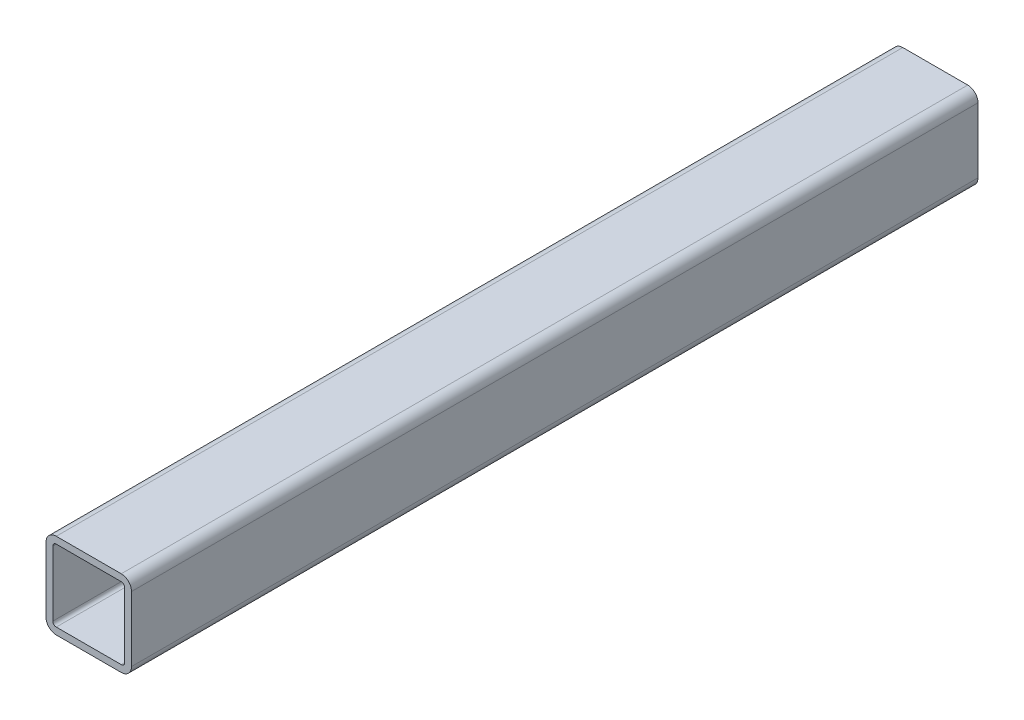
ISO-10303-21;
HEADER;
FILE_DESCRIPTION(('STEP AP214'),'2;1');
FILE_NAME('part.step','',(''),(''),'','','');
FILE_SCHEMA(('AUTOMOTIVE_DESIGN { 1 0 10303 214 1 1 1 1 }'));
ENDSEC;
DATA;
#1=APPLICATION_CONTEXT('core data for automotive mechanical design processes');
#2=APPLICATION_PROTOCOL_DEFINITION('international standard','automotive_design',2000,#1);
#3=PRODUCT_CONTEXT('',#1,'mechanical');
#4=PRODUCT('Part','Part','',(#3));
#5=PRODUCT_RELATED_PRODUCT_CATEGORY('part','',(#4));
#6=PRODUCT_DEFINITION_FORMATION('','',#4);
#7=PRODUCT_DEFINITION_CONTEXT('part definition',#1,'design');
#8=PRODUCT_DEFINITION('design','',#6,#7);
#9=PRODUCT_DEFINITION_SHAPE('','',#8);
#10=(LENGTH_UNIT() NAMED_UNIT(*) SI_UNIT(.MILLI.,.METRE.));
#11=(NAMED_UNIT(*) PLANE_ANGLE_UNIT() SI_UNIT($,.RADIAN.));
#12=(NAMED_UNIT(*) SI_UNIT($,.STERADIAN.) SOLID_ANGLE_UNIT());
#13=UNCERTAINTY_MEASURE_WITH_UNIT(LENGTH_MEASURE(1.E-05),#10,'distance_accuracy_value','');
#14=(GEOMETRIC_REPRESENTATION_CONTEXT(3) GLOBAL_UNCERTAINTY_ASSIGNED_CONTEXT((#13)) GLOBAL_UNIT_ASSIGNED_CONTEXT((#10,
#11,#12)) REPRESENTATION_CONTEXT('',''));
#15=CARTESIAN_POINT('',(0.,0.,0.));
#16=DIRECTION('',(0.,0.,1.));
#17=DIRECTION('',(1.,0.,0.));
#18=AXIS2_PLACEMENT_3D('',#15,#16,#17);
#19=CARTESIAN_POINT('',(0.,0.,247.5));
#20=DIRECTION('',(0.,0.,1.));
#21=DIRECTION('',(1.,0.,0.));
#22=AXIS2_PLACEMENT_3D('',#19,#20,#21);
#23=PLANE('',#22);
#24=DIRECTION('',(0.,1.,0.));
#25=VECTOR('',#24,1.);
#26=CARTESIAN_POINT('',(-12.5,-4.75,247.5));
#27=LINE('',#26,#25);
#28=CARTESIAN_POINT('',(-12.5,-9.5,247.5));
#29=VERTEX_POINT('',#28);
#30=CARTESIAN_POINT('',(-12.5,9.5,247.5));
#31=VERTEX_POINT('',#30);
#32=EDGE_CURVE('E256',#29,#31,#27,.T.);
#33=ORIENTED_EDGE('',*,*,#32,.F.);
#34=CARTESIAN_POINT('',(-9.5,-9.5,247.5));
#35=DIRECTION('',(0.,0.,-1.));
#36=DIRECTION('',(1.,0.,0.));
#37=AXIS2_PLACEMENT_3D('',#34,#35,#36);
#38=CIRCLE('',#37,3.);
#39=CARTESIAN_POINT('',(-9.5,-12.5,247.5));
#40=VERTEX_POINT('',#39);
#41=EDGE_CURVE('E197',#40,#29,#38,.T.);
#42=ORIENTED_EDGE('',*,*,#41,.F.);
#43=DIRECTION('',(-1.,0.,0.));
#44=VECTOR('',#43,1.);
#45=CARTESIAN_POINT('',(4.75,-12.5,247.5));
#46=LINE('',#45,#44);
#47=CARTESIAN_POINT('',(9.5,-12.5,247.5));
#48=VERTEX_POINT('',#47);
#49=EDGE_CURVE('E190',#48,#40,#46,.T.);
#50=ORIENTED_EDGE('',*,*,#49,.F.);
#51=CARTESIAN_POINT('',(9.5,-9.5,247.5));
#52=DIRECTION('',(0.,0.,-1.));
#53=DIRECTION('',(0.,1.,0.));
#54=AXIS2_PLACEMENT_3D('',#51,#52,#53);
#55=CIRCLE('',#54,3.);
#56=CARTESIAN_POINT('',(12.5,-9.5,247.5));
#57=VERTEX_POINT('',#56);
#58=EDGE_CURVE('E266',#57,#48,#55,.T.);
#59=ORIENTED_EDGE('',*,*,#58,.F.);
#60=DIRECTION('',(0.,-1.,0.));
#61=VECTOR('',#60,1.);
#62=CARTESIAN_POINT('',(12.5,4.75,247.5));
#63=LINE('',#62,#61);
#64=CARTESIAN_POINT('',(12.5,9.5,247.5));
#65=VERTEX_POINT('',#64);
#66=EDGE_CURVE('E337',#65,#57,#63,.T.);
#67=ORIENTED_EDGE('',*,*,#66,.F.);
#68=CARTESIAN_POINT('',(9.5,9.5,247.5));
#69=DIRECTION('',(0.,0.,-1.));
#70=DIRECTION('',(-1.,0.,0.));
#71=AXIS2_PLACEMENT_3D('',#68,#69,#70);
#72=CIRCLE('',#71,3.);
#73=CARTESIAN_POINT('',(9.5,12.5,247.5));
#74=VERTEX_POINT('',#73);
#75=EDGE_CURVE('E27',#74,#65,#72,.T.);
#76=ORIENTED_EDGE('',*,*,#75,.F.);
#77=DIRECTION('',(1.,0.,0.));
#78=VECTOR('',#77,1.);
#79=CARTESIAN_POINT('',(-4.75,12.5,247.5));
#80=LINE('',#79,#78);
#81=CARTESIAN_POINT('',(-9.5,12.5,247.5));
#82=VERTEX_POINT('',#81);
#83=EDGE_CURVE('E235',#82,#74,#80,.T.);
#84=ORIENTED_EDGE('',*,*,#83,.F.);
#85=CARTESIAN_POINT('',(-9.5,9.5,247.5));
#86=DIRECTION('',(0.,0.,-1.));
#87=DIRECTION('',(0.,-1.,0.));
#88=AXIS2_PLACEMENT_3D('',#85,#86,#87);
#89=CIRCLE('',#88,3.);
#90=EDGE_CURVE('E225',#31,#82,#89,.T.);
#91=ORIENTED_EDGE('',*,*,#90,.F.);
#92=EDGE_LOOP('',(#33,#42,#50,#59,#67,#76,#84,#91));
#93=FACE_BOUND('',#92,.T.);
#94=DIRECTION('',(-1.,0.,0.));
#95=VECTOR('',#94,1.);
#96=CARTESIAN_POINT('',(-4.75,10.5,247.5));
#97=LINE('',#96,#95);
#98=CARTESIAN_POINT('',(9.5,10.5,247.5));
#99=VERTEX_POINT('',#98);
#100=CARTESIAN_POINT('',(-9.5,10.5,247.5));
#101=VERTEX_POINT('',#100);
#102=EDGE_CURVE('E153',#99,#101,#97,.T.);
#103=ORIENTED_EDGE('',*,*,#102,.F.);
#104=CARTESIAN_POINT('',(9.5,9.5,247.5));
#105=DIRECTION('',(0.,0.,1.));
#106=DIRECTION('',(-1.,0.,0.));
#107=AXIS2_PLACEMENT_3D('',#104,#105,#106);
#108=CIRCLE('',#107,1.);
#109=CARTESIAN_POINT('',(10.5,9.5,247.5));
#110=VERTEX_POINT('',#109);
#111=EDGE_CURVE('E147',#110,#99,#108,.T.);
#112=ORIENTED_EDGE('',*,*,#111,.F.);
#113=DIRECTION('',(0.,1.,0.));
#114=VECTOR('',#113,1.);
#115=CARTESIAN_POINT('',(10.5,4.75,247.5));
#116=LINE('',#115,#114);
#117=CARTESIAN_POINT('',(10.5,-9.5,247.5));
#118=VERTEX_POINT('',#117);
#119=EDGE_CURVE('E150',#118,#110,#116,.T.);
#120=ORIENTED_EDGE('',*,*,#119,.F.);
#121=CARTESIAN_POINT('',(9.5,-9.5,247.5));
#122=DIRECTION('',(0.,0.,1.));
#123=DIRECTION('',(0.,1.,0.));
#124=AXIS2_PLACEMENT_3D('',#121,#122,#123);
#125=CIRCLE('',#124,1.);
#126=CARTESIAN_POINT('',(9.5,-10.5,247.5));
#127=VERTEX_POINT('',#126);
#128=EDGE_CURVE('E217',#127,#118,#125,.T.);
#129=ORIENTED_EDGE('',*,*,#128,.F.);
#130=DIRECTION('',(1.,0.,0.));
#131=VECTOR('',#130,1.);
#132=CARTESIAN_POINT('',(4.75,-10.5,247.5));
#133=LINE('',#132,#131);
#134=CARTESIAN_POINT('',(-9.5,-10.5,247.5));
#135=VERTEX_POINT('',#134);
#136=EDGE_CURVE('E185',#135,#127,#133,.T.);
#137=ORIENTED_EDGE('',*,*,#136,.F.);
#138=CARTESIAN_POINT('',(-9.5,-9.5,247.5));
#139=DIRECTION('',(0.,0.,1.));
#140=DIRECTION('',(1.,0.,0.));
#141=AXIS2_PLACEMENT_3D('',#138,#139,#140);
#142=CIRCLE('',#141,1.);
#143=CARTESIAN_POINT('',(-10.5,-9.5,247.5));
#144=VERTEX_POINT('',#143);
#145=EDGE_CURVE('E208',#144,#135,#142,.T.);
#146=ORIENTED_EDGE('',*,*,#145,.F.);
#147=DIRECTION('',(0.,-1.,0.));
#148=VECTOR('',#147,1.);
#149=CARTESIAN_POINT('',(-10.5,-4.75,247.5));
#150=LINE('',#149,#148);
#151=CARTESIAN_POINT('',(-10.5,9.5,247.5));
#152=VERTEX_POINT('',#151);
#153=EDGE_CURVE('E224',#152,#144,#150,.T.);
#154=ORIENTED_EDGE('',*,*,#153,.F.);
#155=CARTESIAN_POINT('',(-9.5,9.5,247.5));
#156=DIRECTION('',(0.,0.,1.));
#157=DIRECTION('',(0.,-1.,0.));
#158=AXIS2_PLACEMENT_3D('',#155,#156,#157);
#159=CIRCLE('',#158,1.);
#160=EDGE_CURVE('E272',#101,#152,#159,.T.);
#161=ORIENTED_EDGE('',*,*,#160,.F.);
#162=EDGE_LOOP('',(#103,#112,#120,#129,#137,#146,#154,#161));
#163=FACE_BOUND('',#162,.T.);
#164=ADVANCED_FACE('F16',(#93,#163),#23,.T.);
#165=CARTESIAN_POINT('',(0.,0.,0.));
#166=DIRECTION('',(0.,0.,1.));
#167=DIRECTION('',(1.,0.,0.));
#168=AXIS2_PLACEMENT_3D('',#165,#166,#167);
#169=PLANE('',#168);
#170=DIRECTION('',(0.,1.,0.));
#171=VECTOR('',#170,1.);
#172=CARTESIAN_POINT('',(-12.5,-4.75,0.));
#173=LINE('',#172,#171);
#174=CARTESIAN_POINT('',(-12.5,-9.5,0.));
#175=VERTEX_POINT('',#174);
#176=CARTESIAN_POINT('',(-12.5,9.5,0.));
#177=VERTEX_POINT('',#176);
#178=EDGE_CURVE('E230',#175,#177,#173,.T.);
#179=ORIENTED_EDGE('',*,*,#178,.T.);
#180=CARTESIAN_POINT('',(-9.5,9.5,0.));
#181=DIRECTION('',(0.,0.,-1.));
#182=DIRECTION('',(0.,-1.,0.));
#183=AXIS2_PLACEMENT_3D('',#180,#181,#182);
#184=CIRCLE('',#183,3.);
#185=CARTESIAN_POINT('',(-9.5,12.5,0.));
#186=VERTEX_POINT('',#185);
#187=EDGE_CURVE('E239',#177,#186,#184,.T.);
#188=ORIENTED_EDGE('',*,*,#187,.T.);
#189=DIRECTION('',(1.,0.,0.));
#190=VECTOR('',#189,1.);
#191=CARTESIAN_POINT('',(-4.75,12.5,0.));
#192=LINE('',#191,#190);
#193=CARTESIAN_POINT('',(9.5,12.5,0.));
#194=VERTEX_POINT('',#193);
#195=EDGE_CURVE('E241',#186,#194,#192,.T.);
#196=ORIENTED_EDGE('',*,*,#195,.T.);
#197=CARTESIAN_POINT('',(9.5,9.5,0.));
#198=DIRECTION('',(0.,0.,-1.));
#199=DIRECTION('',(-1.,0.,0.));
#200=AXIS2_PLACEMENT_3D('',#197,#198,#199);
#201=CIRCLE('',#200,3.);
#202=CARTESIAN_POINT('',(12.5,9.5,0.));
#203=VERTEX_POINT('',#202);
#204=EDGE_CURVE('E11',#194,#203,#201,.T.);
#205=ORIENTED_EDGE('',*,*,#204,.T.);
#206=DIRECTION('',(0.,-1.,0.));
#207=VECTOR('',#206,1.);
#208=CARTESIAN_POINT('',(12.5,4.75,0.));
#209=LINE('',#208,#207);
#210=CARTESIAN_POINT('',(12.5,-9.5,0.));
#211=VERTEX_POINT('',#210);
#212=EDGE_CURVE('E283',#203,#211,#209,.T.);
#213=ORIENTED_EDGE('',*,*,#212,.T.);
#214=CARTESIAN_POINT('',(9.5,-9.5,0.));
#215=DIRECTION('',(0.,0.,-1.));
#216=DIRECTION('',(0.,1.,0.));
#217=AXIS2_PLACEMENT_3D('',#214,#215,#216);
#218=CIRCLE('',#217,3.);
#219=CARTESIAN_POINT('',(9.5,-12.5,0.));
#220=VERTEX_POINT('',#219);
#221=EDGE_CURVE('E186',#211,#220,#218,.T.);
#222=ORIENTED_EDGE('',*,*,#221,.T.);
#223=DIRECTION('',(-1.,0.,0.));
#224=VECTOR('',#223,1.);
#225=CARTESIAN_POINT('',(4.75,-12.5,0.));
#226=LINE('',#225,#224);
#227=CARTESIAN_POINT('',(-9.5,-12.5,0.));
#228=VERTEX_POINT('',#227);
#229=EDGE_CURVE('E20',#220,#228,#226,.T.);
#230=ORIENTED_EDGE('',*,*,#229,.T.);
#231=CARTESIAN_POINT('',(-9.5,-9.5,0.));
#232=DIRECTION('',(0.,0.,-1.));
#233=DIRECTION('',(1.,0.,0.));
#234=AXIS2_PLACEMENT_3D('',#231,#232,#233);
#235=CIRCLE('',#234,3.);
#236=EDGE_CURVE('E196',#228,#175,#235,.T.);
#237=ORIENTED_EDGE('',*,*,#236,.T.);
#238=EDGE_LOOP('',(#179,#188,#196,#205,#213,#222,#230,#237));
#239=FACE_BOUND('',#238,.T.);
#240=DIRECTION('',(-1.,0.,0.));
#241=VECTOR('',#240,1.);
#242=CARTESIAN_POINT('',(-4.75,10.5,0.));
#243=LINE('',#242,#241);
#244=CARTESIAN_POINT('',(9.5,10.5,0.));
#245=VERTEX_POINT('',#244);
#246=CARTESIAN_POINT('',(-9.5,10.5,0.));
#247=VERTEX_POINT('',#246);
#248=EDGE_CURVE('E213',#245,#247,#243,.T.);
#249=ORIENTED_EDGE('',*,*,#248,.T.);
#250=CARTESIAN_POINT('',(-9.5,9.5,0.));
#251=DIRECTION('',(0.,0.,1.));
#252=DIRECTION('',(0.,-1.,0.));
#253=AXIS2_PLACEMENT_3D('',#250,#251,#252);
#254=CIRCLE('',#253,1.);
#255=CARTESIAN_POINT('',(-10.5,9.5,0.));
#256=VERTEX_POINT('',#255);
#257=EDGE_CURVE('E270',#247,#256,#254,.T.);
#258=ORIENTED_EDGE('',*,*,#257,.T.);
#259=DIRECTION('',(0.,-1.,0.));
#260=VECTOR('',#259,1.);
#261=CARTESIAN_POINT('',(-10.5,-4.75,0.));
#262=LINE('',#261,#260);
#263=CARTESIAN_POINT('',(-10.5,-9.5,0.));
#264=VERTEX_POINT('',#263);
#265=EDGE_CURVE('E219',#256,#264,#262,.T.);
#266=ORIENTED_EDGE('',*,*,#265,.T.);
#267=CARTESIAN_POINT('',(-9.5,-9.5,0.));
#268=DIRECTION('',(0.,0.,1.));
#269=DIRECTION('',(1.,0.,0.));
#270=AXIS2_PLACEMENT_3D('',#267,#268,#269);
#271=CIRCLE('',#270,1.);
#272=CARTESIAN_POINT('',(-9.5,-10.5,0.));
#273=VERTEX_POINT('',#272);
#274=EDGE_CURVE('E212',#264,#273,#271,.T.);
#275=ORIENTED_EDGE('',*,*,#274,.T.);
#276=DIRECTION('',(1.,0.,0.));
#277=VECTOR('',#276,1.);
#278=CARTESIAN_POINT('',(4.75,-10.5,0.));
#279=LINE('',#278,#277);
#280=CARTESIAN_POINT('',(9.5,-10.5,0.));
#281=VERTEX_POINT('',#280);
#282=EDGE_CURVE('E205',#273,#281,#279,.T.);
#283=ORIENTED_EDGE('',*,*,#282,.T.);
#284=CARTESIAN_POINT('',(9.5,-9.5,0.));
#285=DIRECTION('',(0.,0.,1.));
#286=DIRECTION('',(0.,1.,0.));
#287=AXIS2_PLACEMENT_3D('',#284,#285,#286);
#288=CIRCLE('',#287,1.);
#289=CARTESIAN_POINT('',(10.5,-9.5,0.));
#290=VERTEX_POINT('',#289);
#291=EDGE_CURVE('E175',#281,#290,#288,.T.);
#292=ORIENTED_EDGE('',*,*,#291,.T.);
#293=DIRECTION('',(0.,1.,0.));
#294=VECTOR('',#293,1.);
#295=CARTESIAN_POINT('',(10.5,4.75,0.));
#296=LINE('',#295,#294);
#297=CARTESIAN_POINT('',(10.5,9.5,0.));
#298=VERTEX_POINT('',#297);
#299=EDGE_CURVE('E159',#290,#298,#296,.T.);
#300=ORIENTED_EDGE('',*,*,#299,.T.);
#301=CARTESIAN_POINT('',(9.5,9.5,0.));
#302=DIRECTION('',(0.,0.,1.));
#303=DIRECTION('',(-1.,0.,0.));
#304=AXIS2_PLACEMENT_3D('',#301,#302,#303);
#305=CIRCLE('',#304,1.);
#306=EDGE_CURVE('E165',#298,#245,#305,.T.);
#307=ORIENTED_EDGE('',*,*,#306,.T.);
#308=EDGE_LOOP('',(#249,#258,#266,#275,#283,#292,#300,#307));
#309=FACE_BOUND('',#308,.T.);
#310=ADVANCED_FACE('F347',(#239,#309),#169,.F.);
#311=CARTESIAN_POINT('',(9.5,9.5,0.));
#312=DIRECTION('',(0.,0.,1.));
#313=DIRECTION('',(-1.,0.,0.));
#314=AXIS2_PLACEMENT_3D('',#311,#312,#313);
#315=CYLINDRICAL_SURFACE('',#314,3.);
#316=ORIENTED_EDGE('',*,*,#75,.T.);
#317=DIRECTION('',(0.,0.,1.));
#318=VECTOR('',#317,1.);
#319=CARTESIAN_POINT('',(12.5,9.5,0.));
#320=LINE('',#319,#318);
#321=EDGE_CURVE('E280',#203,#65,#320,.T.);
#322=ORIENTED_EDGE('',*,*,#321,.F.);
#323=ORIENTED_EDGE('',*,*,#204,.F.);
#324=DIRECTION('',(0.,0.,1.));
#325=VECTOR('',#324,1.);
#326=CARTESIAN_POINT('',(9.5,12.5,0.));
#327=LINE('',#326,#325);
#328=EDGE_CURVE('E238',#194,#74,#327,.T.);
#329=ORIENTED_EDGE('',*,*,#328,.T.);
#330=EDGE_LOOP('',(#316,#322,#323,#329));
#331=FACE_BOUND('',#330,.T.);
#332=ADVANCED_FACE('F531',(#331),#315,.T.);
#333=CARTESIAN_POINT('',(-9.5,12.5,0.));
#334=DIRECTION('',(0.,1.,0.));
#335=DIRECTION('',(1.,0.,0.));
#336=AXIS2_PLACEMENT_3D('',#333,#334,#335);
#337=PLANE('',#336);
#338=ORIENTED_EDGE('',*,*,#83,.T.);
#339=ORIENTED_EDGE('',*,*,#328,.F.);
#340=ORIENTED_EDGE('',*,*,#195,.F.);
#341=DIRECTION('',(0.,0.,1.));
#342=VECTOR('',#341,1.);
#343=CARTESIAN_POINT('',(-9.5,12.5,0.));
#344=LINE('',#343,#342);
#345=EDGE_CURVE('E229',#186,#82,#344,.T.);
#346=ORIENTED_EDGE('',*,*,#345,.T.);
#347=EDGE_LOOP('',(#338,#339,#340,#346));
#348=FACE_BOUND('',#347,.T.);
#349=ADVANCED_FACE('F526',(#348),#337,.T.);
#350=CARTESIAN_POINT('',(-9.5,9.5,0.));
#351=DIRECTION('',(0.,0.,1.));
#352=DIRECTION('',(0.,-1.,0.));
#353=AXIS2_PLACEMENT_3D('',#350,#351,#352);
#354=CYLINDRICAL_SURFACE('',#353,3.);
#355=ORIENTED_EDGE('',*,*,#90,.T.);
#356=ORIENTED_EDGE('',*,*,#345,.F.);
#357=ORIENTED_EDGE('',*,*,#187,.F.);
#358=DIRECTION('',(0.,0.,1.));
#359=VECTOR('',#358,1.);
#360=CARTESIAN_POINT('',(-12.5,9.5,0.));
#361=LINE('',#360,#359);
#362=EDGE_CURVE('E234',#177,#31,#361,.T.);
#363=ORIENTED_EDGE('',*,*,#362,.T.);
#364=EDGE_LOOP('',(#355,#356,#357,#363));
#365=FACE_BOUND('',#364,.T.);
#366=ADVANCED_FACE('F305',(#365),#354,.T.);
#367=CARTESIAN_POINT('',(-12.5,-9.5,0.));
#368=DIRECTION('',(-1.,0.,0.));
#369=DIRECTION('',(0.,1.,0.));
#370=AXIS2_PLACEMENT_3D('',#367,#368,#369);
#371=PLANE('',#370);
#372=ORIENTED_EDGE('',*,*,#32,.T.);
#373=ORIENTED_EDGE('',*,*,#362,.F.);
#374=ORIENTED_EDGE('',*,*,#178,.F.);
#375=DIRECTION('',(0.,0.,1.));
#376=VECTOR('',#375,1.);
#377=CARTESIAN_POINT('',(-12.5,-9.5,0.));
#378=LINE('',#377,#376);
#379=EDGE_CURVE('E192',#175,#29,#378,.T.);
#380=ORIENTED_EDGE('',*,*,#379,.T.);
#381=EDGE_LOOP('',(#372,#373,#374,#380));
#382=FACE_BOUND('',#381,.T.);
#383=ADVANCED_FACE('F298',(#382),#371,.T.);
#384=CARTESIAN_POINT('',(-9.5,9.5,0.));
#385=DIRECTION('',(0.,0.,1.));
#386=DIRECTION('',(0.,-1.,0.));
#387=AXIS2_PLACEMENT_3D('',#384,#385,#386);
#388=CYLINDRICAL_SURFACE('',#387,1.);
#389=ORIENTED_EDGE('',*,*,#160,.T.);
#390=DIRECTION('',(0.,0.,1.));
#391=VECTOR('',#390,1.);
#392=CARTESIAN_POINT('',(-10.5,9.5,0.));
#393=LINE('',#392,#391);
#394=EDGE_CURVE('E223',#256,#152,#393,.T.);
#395=ORIENTED_EDGE('',*,*,#394,.F.);
#396=ORIENTED_EDGE('',*,*,#257,.F.);
#397=DIRECTION('',(0.,0.,1.));
#398=VECTOR('',#397,1.);
#399=CARTESIAN_POINT('',(-9.5,10.5,0.));
#400=LINE('',#399,#398);
#401=EDGE_CURVE('E200',#247,#101,#400,.T.);
#402=ORIENTED_EDGE('',*,*,#401,.T.);
#403=EDGE_LOOP('',(#389,#395,#396,#402));
#404=FACE_BOUND('',#403,.T.);
#405=ADVANCED_FACE('F18',(#404),#388,.F.);
#406=CARTESIAN_POINT('',(-10.5,-9.5,0.));
#407=DIRECTION('',(-1.,0.,0.));
#408=DIRECTION('',(0.,0.,1.));
#409=AXIS2_PLACEMENT_3D('',#406,#407,#408);
#410=PLANE('',#409);
#411=ORIENTED_EDGE('',*,*,#153,.T.);
#412=DIRECTION('',(0.,0.,1.));
#413=VECTOR('',#412,1.);
#414=CARTESIAN_POINT('',(-10.5,-9.5,0.));
#415=LINE('',#414,#413);
#416=EDGE_CURVE('E269',#264,#144,#415,.T.);
#417=ORIENTED_EDGE('',*,*,#416,.F.);
#418=ORIENTED_EDGE('',*,*,#265,.F.);
#419=ORIENTED_EDGE('',*,*,#394,.T.);
#420=EDGE_LOOP('',(#411,#417,#418,#419));
#421=FACE_BOUND('',#420,.T.);
#422=ADVANCED_FACE('F465',(#421),#410,.F.);
#423=CARTESIAN_POINT('',(-9.5,-9.5,0.));
#424=DIRECTION('',(0.,0.,1.));
#425=DIRECTION('',(1.,0.,0.));
#426=AXIS2_PLACEMENT_3D('',#423,#424,#425);
#427=CYLINDRICAL_SURFACE('',#426,1.);
#428=ORIENTED_EDGE('',*,*,#145,.T.);
#429=DIRECTION('',(0.,0.,1.));
#430=VECTOR('',#429,1.);
#431=CARTESIAN_POINT('',(-9.5,-10.5,0.));
#432=LINE('',#431,#430);
#433=EDGE_CURVE('E214',#273,#135,#432,.T.);
#434=ORIENTED_EDGE('',*,*,#433,.F.);
#435=ORIENTED_EDGE('',*,*,#274,.F.);
#436=ORIENTED_EDGE('',*,*,#416,.T.);
#437=EDGE_LOOP('',(#428,#434,#435,#436));
#438=FACE_BOUND('',#437,.T.);
#439=ADVANCED_FACE('F546',(#438),#427,.F.);
#440=CARTESIAN_POINT('',(-9.5,10.5,0.));
#441=DIRECTION('',(0.,1.,0.));
#442=DIRECTION('',(1.,0.,0.));
#443=AXIS2_PLACEMENT_3D('',#440,#441,#442);
#444=PLANE('',#443);
#445=ORIENTED_EDGE('',*,*,#102,.T.);
#446=ORIENTED_EDGE('',*,*,#401,.F.);
#447=ORIENTED_EDGE('',*,*,#248,.F.);
#448=DIRECTION('',(0.,0.,1.));
#449=VECTOR('',#448,1.);
#450=CARTESIAN_POINT('',(9.5,10.5,0.));
#451=LINE('',#450,#449);
#452=EDGE_CURVE('E158',#245,#99,#451,.T.);
#453=ORIENTED_EDGE('',*,*,#452,.T.);
#454=EDGE_LOOP('',(#445,#446,#447,#453));
#455=FACE_BOUND('',#454,.T.);
#456=ADVANCED_FACE('F459',(#455),#444,.F.);
#457=CARTESIAN_POINT('',(-9.5,-9.5,0.));
#458=DIRECTION('',(0.,0.,1.));
#459=DIRECTION('',(1.,0.,0.));
#460=AXIS2_PLACEMENT_3D('',#457,#458,#459);
#461=CYLINDRICAL_SURFACE('',#460,3.);
#462=ORIENTED_EDGE('',*,*,#41,.T.);
#463=ORIENTED_EDGE('',*,*,#379,.F.);
#464=ORIENTED_EDGE('',*,*,#236,.F.);
#465=DIRECTION('',(0.,0.,1.));
#466=VECTOR('',#465,1.);
#467=CARTESIAN_POINT('',(-9.5,-12.5,0.));
#468=LINE('',#467,#466);
#469=EDGE_CURVE('E315',#228,#40,#468,.T.);
#470=ORIENTED_EDGE('',*,*,#469,.T.);
#471=EDGE_LOOP('',(#462,#463,#464,#470));
#472=FACE_BOUND('',#471,.T.);
#473=ADVANCED_FACE('F478',(#472),#461,.T.);
#474=CARTESIAN_POINT('',(9.5,-12.5,0.));
#475=DIRECTION('',(0.,-1.,0.));
#476=DIRECTION('',(0.,0.,-1.));
#477=AXIS2_PLACEMENT_3D('',#474,#475,#476);
#478=PLANE('',#477);
#479=ORIENTED_EDGE('',*,*,#49,.T.);
#480=ORIENTED_EDGE('',*,*,#469,.F.);
#481=ORIENTED_EDGE('',*,*,#229,.F.);
#482=DIRECTION('',(0.,0.,1.));
#483=VECTOR('',#482,1.);
#484=CARTESIAN_POINT('',(9.5,-12.5,0.));
#485=LINE('',#484,#483);
#486=EDGE_CURVE('E191',#220,#48,#485,.T.);
#487=ORIENTED_EDGE('',*,*,#486,.T.);
#488=EDGE_LOOP('',(#479,#480,#481,#487));
#489=FACE_BOUND('',#488,.T.);
#490=ADVANCED_FACE('F343',(#489),#478,.T.);
#491=CARTESIAN_POINT('',(9.5,-9.5,0.));
#492=DIRECTION('',(0.,0.,1.));
#493=DIRECTION('',(0.,1.,0.));
#494=AXIS2_PLACEMENT_3D('',#491,#492,#493);
#495=CYLINDRICAL_SURFACE('',#494,3.);
#496=ORIENTED_EDGE('',*,*,#58,.T.);
#497=ORIENTED_EDGE('',*,*,#486,.F.);
#498=ORIENTED_EDGE('',*,*,#221,.F.);
#499=DIRECTION('',(0.,0.,1.));
#500=VECTOR('',#499,1.);
#501=CARTESIAN_POINT('',(12.5,-9.5,0.));
#502=LINE('',#501,#500);
#503=EDGE_CURVE('E332',#211,#57,#502,.T.);
#504=ORIENTED_EDGE('',*,*,#503,.T.);
#505=EDGE_LOOP('',(#496,#497,#498,#504));
#506=FACE_BOUND('',#505,.T.);
#507=ADVANCED_FACE('F330',(#506),#495,.T.);
#508=CARTESIAN_POINT('',(12.5,9.5,0.));
#509=DIRECTION('',(1.,0.,0.));
#510=DIRECTION('',(0.,1.,0.));
#511=AXIS2_PLACEMENT_3D('',#508,#509,#510);
#512=PLANE('',#511);
#513=ORIENTED_EDGE('',*,*,#66,.T.);
#514=ORIENTED_EDGE('',*,*,#503,.F.);
#515=ORIENTED_EDGE('',*,*,#212,.F.);
#516=ORIENTED_EDGE('',*,*,#321,.T.);
#517=EDGE_LOOP('',(#513,#514,#515,#516));
#518=FACE_BOUND('',#517,.T.);
#519=ADVANCED_FACE('F353',(#518),#512,.T.);
#520=CARTESIAN_POINT('',(9.5,9.5,0.));
#521=DIRECTION('',(0.,0.,1.));
#522=DIRECTION('',(-1.,0.,0.));
#523=AXIS2_PLACEMENT_3D('',#520,#521,#522);
#524=CYLINDRICAL_SURFACE('',#523,1.);
#525=ORIENTED_EDGE('',*,*,#111,.T.);
#526=ORIENTED_EDGE('',*,*,#452,.F.);
#527=ORIENTED_EDGE('',*,*,#306,.F.);
#528=DIRECTION('',(0.,0.,1.));
#529=VECTOR('',#528,1.);
#530=CARTESIAN_POINT('',(10.5,9.5,0.));
#531=LINE('',#530,#529);
#532=EDGE_CURVE('E162',#298,#110,#531,.T.);
#533=ORIENTED_EDGE('',*,*,#532,.T.);
#534=EDGE_LOOP('',(#525,#526,#527,#533));
#535=FACE_BOUND('',#534,.T.);
#536=ADVANCED_FACE('F163',(#535),#524,.F.);
#537=CARTESIAN_POINT('',(10.5,9.5,0.));
#538=DIRECTION('',(1.,0.,0.));
#539=DIRECTION('',(0.,-1.,0.));
#540=AXIS2_PLACEMENT_3D('',#537,#538,#539);
#541=PLANE('',#540);
#542=ORIENTED_EDGE('',*,*,#119,.T.);
#543=ORIENTED_EDGE('',*,*,#532,.F.);
#544=ORIENTED_EDGE('',*,*,#299,.F.);
#545=DIRECTION('',(0.,0.,1.));
#546=VECTOR('',#545,1.);
#547=CARTESIAN_POINT('',(10.5,-9.5,0.));
#548=LINE('',#547,#546);
#549=EDGE_CURVE('E172',#290,#118,#548,.T.);
#550=ORIENTED_EDGE('',*,*,#549,.T.);
#551=EDGE_LOOP('',(#542,#543,#544,#550));
#552=FACE_BOUND('',#551,.T.);
#553=ADVANCED_FACE('F170',(#552),#541,.F.);
#554=CARTESIAN_POINT('',(9.5,-9.5,0.));
#555=DIRECTION('',(0.,0.,1.));
#556=DIRECTION('',(0.,1.,0.));
#557=AXIS2_PLACEMENT_3D('',#554,#555,#556);
#558=CYLINDRICAL_SURFACE('',#557,1.);
#559=ORIENTED_EDGE('',*,*,#128,.T.);
#560=ORIENTED_EDGE('',*,*,#549,.F.);
#561=ORIENTED_EDGE('',*,*,#291,.F.);
#562=DIRECTION('',(0.,0.,1.));
#563=VECTOR('',#562,1.);
#564=CARTESIAN_POINT('',(9.5,-10.5,0.));
#565=LINE('',#564,#563);
#566=EDGE_CURVE('E201',#281,#127,#565,.T.);
#567=ORIENTED_EDGE('',*,*,#566,.T.);
#568=EDGE_LOOP('',(#559,#560,#561,#567));
#569=FACE_BOUND('',#568,.T.);
#570=ADVANCED_FACE('F520',(#569),#558,.F.);
#571=CARTESIAN_POINT('',(9.5,-10.5,0.));
#572=DIRECTION('',(0.,-1.,0.));
#573=DIRECTION('',(0.,0.,-1.));
#574=AXIS2_PLACEMENT_3D('',#571,#572,#573);
#575=PLANE('',#574);
#576=ORIENTED_EDGE('',*,*,#136,.T.);
#577=ORIENTED_EDGE('',*,*,#566,.F.);
#578=ORIENTED_EDGE('',*,*,#282,.F.);
#579=ORIENTED_EDGE('',*,*,#433,.T.);
#580=EDGE_LOOP('',(#576,#577,#578,#579));
#581=FACE_BOUND('',#580,.T.);
#582=ADVANCED_FACE('F540',(#581),#575,.F.);
#583=CLOSED_SHELL('',(#164,#310,#332,#349,#366,#383,#405,#422,#439,#456,#473,#490,#507,#519,
#536,#553,#570,#582));
#584=MANIFOLD_SOLID_BREP('B1',#583);
#585=ADVANCED_BREP_SHAPE_REPRESENTATION('',(#18,#584),#14);
#586=SHAPE_DEFINITION_REPRESENTATION(#9,#585);
ENDSEC;
END-ISO-10303-21;
